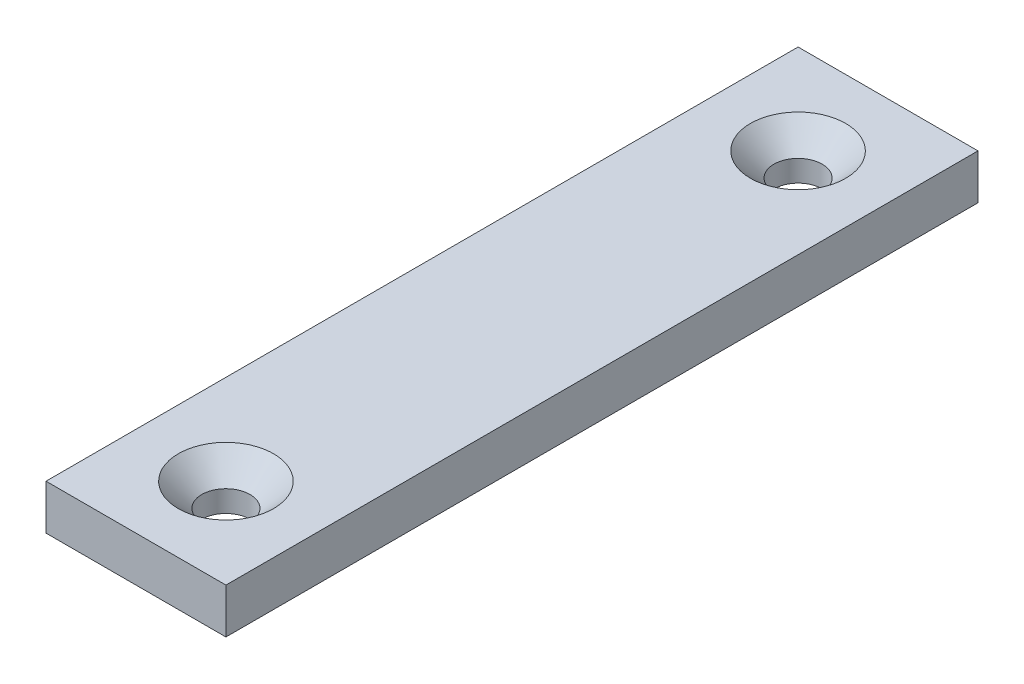
ISO-10303-21;
HEADER;
FILE_DESCRIPTION(('STEP AP214'),'2;1');
FILE_NAME('part.step','',(''),(''),'','','');
FILE_SCHEMA(('AUTOMOTIVE_DESIGN { 1 0 10303 214 1 1 1 1 }'));
ENDSEC;
DATA;
#1=APPLICATION_CONTEXT('core data for automotive mechanical design processes');
#2=APPLICATION_PROTOCOL_DEFINITION('international standard','automotive_design',2000,#1);
#3=PRODUCT_CONTEXT('',#1,'mechanical');
#4=PRODUCT('Part','Part','',(#3));
#5=PRODUCT_RELATED_PRODUCT_CATEGORY('part','',(#4));
#6=PRODUCT_DEFINITION_FORMATION('','',#4);
#7=PRODUCT_DEFINITION_CONTEXT('part definition',#1,'design');
#8=PRODUCT_DEFINITION('design','',#6,#7);
#9=PRODUCT_DEFINITION_SHAPE('','',#8);
#10=(LENGTH_UNIT() NAMED_UNIT(*) SI_UNIT(.MILLI.,.METRE.));
#11=(NAMED_UNIT(*) PLANE_ANGLE_UNIT() SI_UNIT($,.RADIAN.));
#12=(NAMED_UNIT(*) SI_UNIT($,.STERADIAN.) SOLID_ANGLE_UNIT());
#13=UNCERTAINTY_MEASURE_WITH_UNIT(LENGTH_MEASURE(1.E-05),#10,'distance_accuracy_value','');
#14=(GEOMETRIC_REPRESENTATION_CONTEXT(3) GLOBAL_UNCERTAINTY_ASSIGNED_CONTEXT((#13)) GLOBAL_UNIT_ASSIGNED_CONTEXT((#10,
#11,#12)) REPRESENTATION_CONTEXT('',''));
#15=CARTESIAN_POINT('',(0.,0.,0.));
#16=DIRECTION('',(0.,0.,1.));
#17=DIRECTION('',(1.,0.,0.));
#18=AXIS2_PLACEMENT_3D('',#15,#16,#17);
#19=CARTESIAN_POINT('',(0.,3.175,0.));
#20=DIRECTION('',(1.,0.,0.));
#21=DIRECTION('',(0.,0.,-1.));
#22=AXIS2_PLACEMENT_3D('',#19,#20,#21);
#23=PLANE('',#22);
#24=DIRECTION('',(0.,0.,1.));
#25=VECTOR('',#24,1.);
#26=CARTESIAN_POINT('',(0.,0.,0.));
#27=LINE('',#26,#25);
#28=CARTESIAN_POINT('',(0.,0.,-53.086));
#29=VERTEX_POINT('',#28);
#30=CARTESIAN_POINT('',(0.,0.,0.));
#31=VERTEX_POINT('',#30);
#32=EDGE_CURVE('E96',#29,#31,#27,.T.);
#33=ORIENTED_EDGE('',*,*,#32,.T.);
#34=DIRECTION('',(0.,-1.,0.));
#35=VECTOR('',#34,1.);
#36=CARTESIAN_POINT('',(0.,3.175,0.));
#37=LINE('',#36,#35);
#38=CARTESIAN_POINT('',(0.,3.175,0.));
#39=VERTEX_POINT('',#38);
#40=EDGE_CURVE('E11',#39,#31,#37,.T.);
#41=ORIENTED_EDGE('',*,*,#40,.F.);
#42=DIRECTION('',(0.,0.,1.));
#43=VECTOR('',#42,1.);
#44=CARTESIAN_POINT('',(0.,3.175,0.));
#45=LINE('',#44,#43);
#46=CARTESIAN_POINT('',(0.,3.175,-53.086));
#47=VERTEX_POINT('',#46);
#48=EDGE_CURVE('E84',#47,#39,#45,.T.);
#49=ORIENTED_EDGE('',*,*,#48,.F.);
#50=DIRECTION('',(0.,-1.,0.));
#51=VECTOR('',#50,1.);
#52=CARTESIAN_POINT('',(0.,3.175,-53.086));
#53=LINE('',#52,#51);
#54=EDGE_CURVE('E92',#47,#29,#53,.T.);
#55=ORIENTED_EDGE('',*,*,#54,.T.);
#56=EDGE_LOOP('',(#33,#41,#49,#55));
#57=FACE_BOUND('',#56,.T.);
#58=ADVANCED_FACE('F33',(#57),#23,.F.);
#59=CARTESIAN_POINT('',(0.,3.175,0.));
#60=DIRECTION('',(0.,0.,-1.));
#61=DIRECTION('',(-1.,0.,0.));
#62=AXIS2_PLACEMENT_3D('',#59,#60,#61);
#63=PLANE('',#62);
#64=DIRECTION('',(1.,0.,0.));
#65=VECTOR('',#64,1.);
#66=CARTESIAN_POINT('',(0.,0.,0.));
#67=LINE('',#66,#65);
#68=CARTESIAN_POINT('',(12.7,0.,0.));
#69=VERTEX_POINT('',#68);
#70=EDGE_CURVE('E88',#31,#69,#67,.T.);
#71=ORIENTED_EDGE('',*,*,#70,.T.);
#72=DIRECTION('',(0.,-1.,0.));
#73=VECTOR('',#72,1.);
#74=CARTESIAN_POINT('',(12.7,3.175,0.));
#75=LINE('',#74,#73);
#76=CARTESIAN_POINT('',(12.7,3.175,0.));
#77=VERTEX_POINT('',#76);
#78=EDGE_CURVE('E41',#77,#69,#75,.T.);
#79=ORIENTED_EDGE('',*,*,#78,.F.);
#80=DIRECTION('',(1.,0.,0.));
#81=VECTOR('',#80,1.);
#82=CARTESIAN_POINT('',(0.,3.175,0.));
#83=LINE('',#82,#81);
#84=EDGE_CURVE('E79',#39,#77,#83,.T.);
#85=ORIENTED_EDGE('',*,*,#84,.F.);
#86=ORIENTED_EDGE('',*,*,#40,.T.);
#87=EDGE_LOOP('',(#71,#79,#85,#86));
#88=FACE_BOUND('',#87,.T.);
#89=ADVANCED_FACE('F87',(#88),#63,.F.);
#90=CARTESIAN_POINT('',(12.7,3.175,0.));
#91=DIRECTION('',(-1.,0.,0.));
#92=DIRECTION('',(0.,0.,1.));
#93=AXIS2_PLACEMENT_3D('',#90,#91,#92);
#94=PLANE('',#93);
#95=DIRECTION('',(0.,0.,-1.));
#96=VECTOR('',#95,1.);
#97=CARTESIAN_POINT('',(12.7,0.,0.));
#98=LINE('',#97,#96);
#99=CARTESIAN_POINT('',(12.7,0.,-53.086));
#100=VERTEX_POINT('',#99);
#101=EDGE_CURVE('E66',#69,#100,#98,.T.);
#102=ORIENTED_EDGE('',*,*,#101,.T.);
#103=DIRECTION('',(0.,-1.,0.));
#104=VECTOR('',#103,1.);
#105=CARTESIAN_POINT('',(12.7,3.175,-53.086));
#106=LINE('',#105,#104);
#107=CARTESIAN_POINT('',(12.7,3.175,-53.086));
#108=VERTEX_POINT('',#107);
#109=EDGE_CURVE('E89',#108,#100,#106,.T.);
#110=ORIENTED_EDGE('',*,*,#109,.F.);
#111=DIRECTION('',(0.,0.,-1.));
#112=VECTOR('',#111,1.);
#113=CARTESIAN_POINT('',(12.7,3.175,0.));
#114=LINE('',#113,#112);
#115=EDGE_CURVE('E82',#77,#108,#114,.T.);
#116=ORIENTED_EDGE('',*,*,#115,.F.);
#117=ORIENTED_EDGE('',*,*,#78,.T.);
#118=EDGE_LOOP('',(#102,#110,#116,#117));
#119=FACE_BOUND('',#118,.T.);
#120=ADVANCED_FACE('F90',(#119),#94,.F.);
#121=CARTESIAN_POINT('',(0.,3.175,-53.086));
#122=DIRECTION('',(0.,0.,1.));
#123=DIRECTION('',(1.,0.,0.));
#124=AXIS2_PLACEMENT_3D('',#121,#122,#123);
#125=PLANE('',#124);
#126=DIRECTION('',(-1.,0.,0.));
#127=VECTOR('',#126,1.);
#128=CARTESIAN_POINT('',(0.,0.,-53.086));
#129=LINE('',#128,#127);
#130=EDGE_CURVE('E72',#100,#29,#129,.T.);
#131=ORIENTED_EDGE('',*,*,#130,.T.);
#132=ORIENTED_EDGE('',*,*,#54,.F.);
#133=DIRECTION('',(-1.,0.,0.));
#134=VECTOR('',#133,1.);
#135=CARTESIAN_POINT('',(0.,3.175,-53.086));
#136=LINE('',#135,#134);
#137=EDGE_CURVE('E49',#108,#47,#136,.T.);
#138=ORIENTED_EDGE('',*,*,#137,.F.);
#139=ORIENTED_EDGE('',*,*,#109,.T.);
#140=EDGE_LOOP('',(#131,#132,#138,#139));
#141=FACE_BOUND('',#140,.T.);
#142=ADVANCED_FACE('F104',(#141),#125,.F.);
#143=CARTESIAN_POINT('',(0.,3.175,0.));
#144=DIRECTION('',(0.,-1.,0.));
#145=DIRECTION('',(0.,0.,-1.));
#146=AXIS2_PLACEMENT_3D('',#143,#144,#145);
#147=PLANE('',#146);
#148=CARTESIAN_POINT('',(6.35,3.175,-6.35));
#149=DIRECTION('',(0.,1.,0.));
#150=DIRECTION('',(0.,0.,1.));
#151=AXIS2_PLACEMENT_3D('',#148,#149,#150);
#152=CIRCLE('',#151,3.36);
#153=CARTESIAN_POINT('',(6.35,3.175,-2.99));
#154=VERTEX_POINT('',#153);
#155=EDGE_CURVE('E124',#154,#154,#152,.T.);
#156=ORIENTED_EDGE('',*,*,#155,.F.);
#157=EDGE_LOOP('',(#156));
#158=FACE_BOUND('',#157,.T.);
#159=CARTESIAN_POINT('',(6.35,3.175,-46.736));
#160=DIRECTION('',(0.,1.,0.));
#161=DIRECTION('',(0.,0.,1.));
#162=AXIS2_PLACEMENT_3D('',#159,#160,#161);
#163=CIRCLE('',#162,3.36);
#164=CARTESIAN_POINT('',(6.35,3.175,-43.376));
#165=VERTEX_POINT('',#164);
#166=EDGE_CURVE('E115',#165,#165,#163,.T.);
#167=ORIENTED_EDGE('',*,*,#166,.F.);
#168=EDGE_LOOP('',(#167));
#169=FACE_BOUND('',#168,.T.);
#170=ORIENTED_EDGE('',*,*,#48,.T.);
#171=ORIENTED_EDGE('',*,*,#84,.T.);
#172=ORIENTED_EDGE('',*,*,#115,.T.);
#173=ORIENTED_EDGE('',*,*,#137,.T.);
#174=EDGE_LOOP('',(#170,#171,#172,#173));
#175=FACE_BOUND('',#174,.T.);
#176=ADVANCED_FACE('F80',(#158,#169,#175),#147,.F.);
#177=CARTESIAN_POINT('',(0.,0.,0.));
#178=DIRECTION('',(0.,-1.,0.));
#179=DIRECTION('',(0.,0.,-1.));
#180=AXIS2_PLACEMENT_3D('',#177,#178,#179);
#181=PLANE('',#180);
#182=CARTESIAN_POINT('',(6.35,0.,-6.35));
#183=DIRECTION('',(0.,1.,0.));
#184=DIRECTION('',(0.,0.,1.));
#185=AXIS2_PLACEMENT_3D('',#182,#183,#184);
#186=CIRCLE('',#185,1.7);
#187=CARTESIAN_POINT('',(6.35,0.,-4.65));
#188=VERTEX_POINT('',#187);
#189=EDGE_CURVE('E118',#188,#188,#186,.T.);
#190=ORIENTED_EDGE('',*,*,#189,.T.);
#191=EDGE_LOOP('',(#190));
#192=FACE_BOUND('',#191,.T.);
#193=CARTESIAN_POINT('',(6.35,0.,-46.736));
#194=DIRECTION('',(0.,1.,0.));
#195=DIRECTION('',(0.,0.,1.));
#196=AXIS2_PLACEMENT_3D('',#193,#194,#195);
#197=CIRCLE('',#196,1.7);
#198=CARTESIAN_POINT('',(6.35,0.,-45.036));
#199=VERTEX_POINT('',#198);
#200=EDGE_CURVE('E99',#199,#199,#197,.T.);
#201=ORIENTED_EDGE('',*,*,#200,.T.);
#202=EDGE_LOOP('',(#201));
#203=FACE_BOUND('',#202,.T.);
#204=ORIENTED_EDGE('',*,*,#32,.F.);
#205=ORIENTED_EDGE('',*,*,#130,.F.);
#206=ORIENTED_EDGE('',*,*,#101,.F.);
#207=ORIENTED_EDGE('',*,*,#70,.F.);
#208=EDGE_LOOP('',(#204,#205,#206,#207));
#209=FACE_BOUND('',#208,.T.);
#210=ADVANCED_FACE('F107',(#192,#203,#209),#181,.T.);
#211=CARTESIAN_POINT('',(6.35,3.175,-46.736));
#212=DIRECTION('',(0.,1.,0.));
#213=DIRECTION('',(0.,0.,1.));
#214=AXIS2_PLACEMENT_3D('',#211,#212,#213);
#215=CYLINDRICAL_SURFACE('',#214,1.7);
#216=ORIENTED_EDGE('',*,*,#200,.F.);
#217=EDGE_LOOP('',(#216));
#218=FACE_BOUND('',#217,.T.);
#219=CARTESIAN_POINT('',(6.35,1.515,-46.736));
#220=DIRECTION('',(0.,1.,0.));
#221=DIRECTION('',(0.,0.,1.));
#222=AXIS2_PLACEMENT_3D('',#219,#220,#221);
#223=CIRCLE('',#222,1.7);
#224=CARTESIAN_POINT('',(6.35,1.515,-45.036));
#225=VERTEX_POINT('',#224);
#226=EDGE_CURVE('E112',#225,#225,#223,.T.);
#227=ORIENTED_EDGE('',*,*,#226,.T.);
#228=EDGE_LOOP('',(#227));
#229=FACE_BOUND('',#228,.T.);
#230=ADVANCED_FACE('F138',(#218,#229),#215,.F.);
#231=CARTESIAN_POINT('',(6.35,3.175,-46.736));
#232=DIRECTION('',(0.,1.,0.));
#233=DIRECTION('',(0.,0.,1.));
#234=AXIS2_PLACEMENT_3D('',#231,#232,#233);
#235=CONICAL_SURFACE('',#234,3.36,0.785398163397448);
#236=ORIENTED_EDGE('',*,*,#226,.F.);
#237=EDGE_LOOP('',(#236));
#238=FACE_BOUND('',#237,.T.);
#239=ORIENTED_EDGE('',*,*,#166,.T.);
#240=EDGE_LOOP('',(#239));
#241=FACE_BOUND('',#240,.T.);
#242=ADVANCED_FACE('F135',(#238,#241),#235,.F.);
#243=CARTESIAN_POINT('',(6.35,3.175,-6.35));
#244=DIRECTION('',(0.,1.,0.));
#245=DIRECTION('',(0.,0.,1.));
#246=AXIS2_PLACEMENT_3D('',#243,#244,#245);
#247=CYLINDRICAL_SURFACE('',#246,1.7);
#248=ORIENTED_EDGE('',*,*,#189,.F.);
#249=EDGE_LOOP('',(#248));
#250=FACE_BOUND('',#249,.T.);
#251=CARTESIAN_POINT('',(6.35,1.515,-6.35));
#252=DIRECTION('',(0.,1.,0.));
#253=DIRECTION('',(0.,0.,1.));
#254=AXIS2_PLACEMENT_3D('',#251,#252,#253);
#255=CIRCLE('',#254,1.7);
#256=CARTESIAN_POINT('',(6.35,1.515,-4.65));
#257=VERTEX_POINT('',#256);
#258=EDGE_CURVE('E121',#257,#257,#255,.T.);
#259=ORIENTED_EDGE('',*,*,#258,.T.);
#260=EDGE_LOOP('',(#259));
#261=FACE_BOUND('',#260,.T.);
#262=ADVANCED_FACE('F137',(#250,#261),#247,.F.);
#263=CARTESIAN_POINT('',(6.35,3.175,-6.35));
#264=DIRECTION('',(0.,1.,0.));
#265=DIRECTION('',(0.,0.,1.));
#266=AXIS2_PLACEMENT_3D('',#263,#264,#265);
#267=CONICAL_SURFACE('',#266,3.36,0.785398163397448);
#268=ORIENTED_EDGE('',*,*,#258,.F.);
#269=EDGE_LOOP('',(#268));
#270=FACE_BOUND('',#269,.T.);
#271=ORIENTED_EDGE('',*,*,#155,.T.);
#272=EDGE_LOOP('',(#271));
#273=FACE_BOUND('',#272,.T.);
#274=ADVANCED_FACE('F128',(#270,#273),#267,.F.);
#275=CLOSED_SHELL('',(#58,#89,#120,#142,#176,#210,#230,#242,#262,#274));
#276=MANIFOLD_SOLID_BREP('B2',#275);
#277=ADVANCED_BREP_SHAPE_REPRESENTATION('',(#18,#276),#14);
#278=SHAPE_DEFINITION_REPRESENTATION(#9,#277);
ENDSEC;
END-ISO-10303-21;
